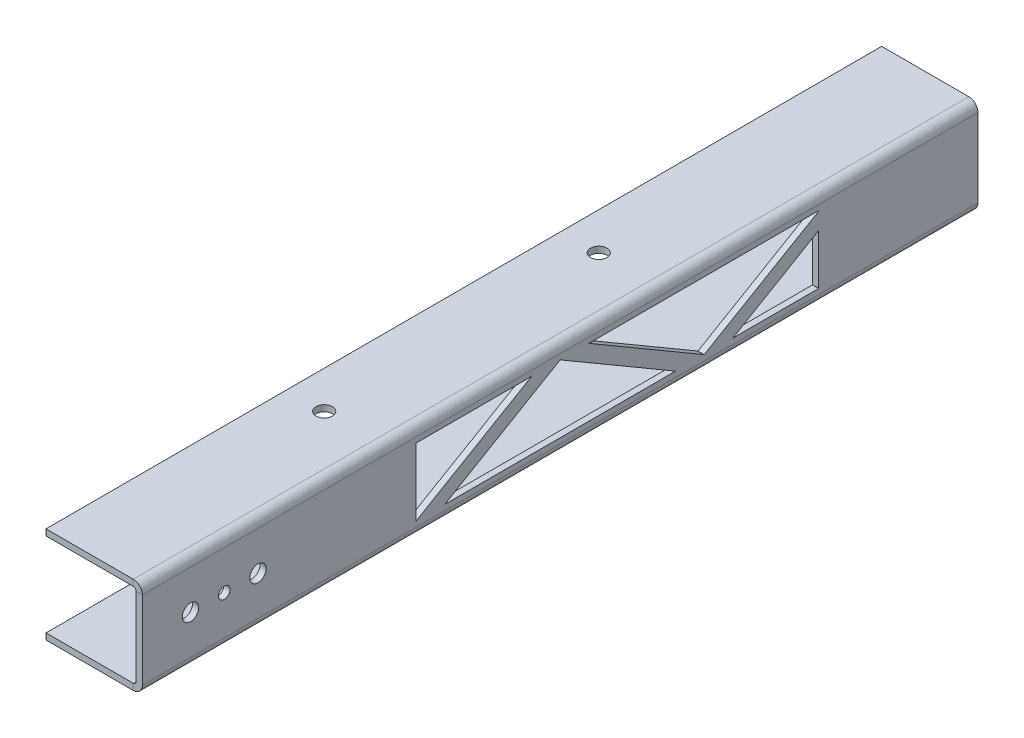
ISO-10303-21;
HEADER;
FILE_DESCRIPTION(('STEP AP214'),'2;1');
FILE_NAME('part.step','',(''),(''),'','','');
FILE_SCHEMA(('AUTOMOTIVE_DESIGN { 1 0 10303 214 1 1 1 1 }'));
ENDSEC;
DATA;
#1=APPLICATION_CONTEXT('core data for automotive mechanical design processes');
#2=APPLICATION_PROTOCOL_DEFINITION('international standard','automotive_design',2000,#1);
#3=PRODUCT_CONTEXT('',#1,'mechanical');
#4=PRODUCT('Part','Part','',(#3));
#5=PRODUCT_RELATED_PRODUCT_CATEGORY('part','',(#4));
#6=PRODUCT_DEFINITION_FORMATION('','',#4);
#7=PRODUCT_DEFINITION_CONTEXT('part definition',#1,'design');
#8=PRODUCT_DEFINITION('design','',#6,#7);
#9=PRODUCT_DEFINITION_SHAPE('','',#8);
#10=(LENGTH_UNIT() NAMED_UNIT(*) SI_UNIT(.MILLI.,.METRE.));
#11=(NAMED_UNIT(*) PLANE_ANGLE_UNIT() SI_UNIT($,.RADIAN.));
#12=(NAMED_UNIT(*) SI_UNIT($,.STERADIAN.) SOLID_ANGLE_UNIT());
#13=UNCERTAINTY_MEASURE_WITH_UNIT(LENGTH_MEASURE(1.E-05),#10,'distance_accuracy_value','');
#14=(GEOMETRIC_REPRESENTATION_CONTEXT(3) GLOBAL_UNCERTAINTY_ASSIGNED_CONTEXT((#13)) GLOBAL_UNIT_ASSIGNED_CONTEXT((#10,
#11,#12)) REPRESENTATION_CONTEXT('',''));
#15=CARTESIAN_POINT('',(0.,0.,0.));
#16=DIRECTION('',(0.,0.,1.));
#17=DIRECTION('',(1.,0.,0.));
#18=AXIS2_PLACEMENT_3D('',#15,#16,#17);
#19=CARTESIAN_POINT('',(0.,20.,0.));
#20=DIRECTION('',(0.,0.,1.));
#21=DIRECTION('',(1.,0.,0.));
#22=AXIS2_PLACEMENT_3D('',#19,#20,#21);
#23=PLANE('',#22);
#24=DIRECTION('',(0.,1.,0.));
#25=VECTOR('',#24,1.);
#26=CARTESIAN_POINT('',(18.11,20.,0.));
#27=LINE('',#26,#25);
#28=CARTESIAN_POINT('',(18.11,18.71,0.));
#29=VERTEX_POINT('',#28);
#30=CARTESIAN_POINT('',(18.11,20.,0.));
#31=VERTEX_POINT('',#30);
#32=EDGE_CURVE('E438',#29,#31,#27,.T.);
#33=ORIENTED_EDGE('',*,*,#32,.F.);
#34=DIRECTION('',(1.,0.,0.));
#35=VECTOR('',#34,1.);
#36=CARTESIAN_POINT('',(0.,18.71,0.));
#37=LINE('',#36,#35);
#38=CARTESIAN_POINT('',(0.,18.71,0.));
#39=VERTEX_POINT('',#38);
#40=EDGE_CURVE('E401',#39,#29,#37,.T.);
#41=ORIENTED_EDGE('',*,*,#40,.F.);
#42=DIRECTION('',(0.,1.,0.));
#43=VECTOR('',#42,1.);
#44=CARTESIAN_POINT('',(0.,20.,0.));
#45=LINE('',#44,#43);
#46=CARTESIAN_POINT('',(0.,20.,0.));
#47=VERTEX_POINT('',#46);
#48=EDGE_CURVE('E436',#39,#47,#45,.T.);
#49=ORIENTED_EDGE('',*,*,#48,.T.);
#50=DIRECTION('',(1.,0.,0.));
#51=VECTOR('',#50,1.);
#52=CARTESIAN_POINT('',(0.,20.,0.));
#53=LINE('',#52,#51);
#54=EDGE_CURVE('E332',#47,#31,#53,.T.);
#55=ORIENTED_EDGE('',*,*,#54,.T.);
#56=EDGE_LOOP('',(#33,#41,#49,#55));
#57=FACE_BOUND('',#56,.T.);
#58=ADVANCED_FACE('F37',(#57),#23,.F.);
#59=CARTESIAN_POINT('',(0.,20.,173.5));
#60=DIRECTION('',(1.,0.,0.));
#61=DIRECTION('',(0.,0.,-1.));
#62=AXIS2_PLACEMENT_3D('',#59,#60,#61);
#63=PLANE('',#62);
#64=ORIENTED_EDGE('',*,*,#48,.F.);
#65=DIRECTION('',(0.,0.,1.));
#66=VECTOR('',#65,1.);
#67=CARTESIAN_POINT('',(0.,18.71,173.5));
#68=LINE('',#67,#66);
#69=CARTESIAN_POINT('',(0.,18.71,173.5));
#70=VERTEX_POINT('',#69);
#71=EDGE_CURVE('E412',#70,#39,#68,.F.);
#72=ORIENTED_EDGE('',*,*,#71,.F.);
#73=DIRECTION('',(0.,1.,0.));
#74=VECTOR('',#73,1.);
#75=CARTESIAN_POINT('',(0.,20.,173.5));
#76=LINE('',#75,#74);
#77=CARTESIAN_POINT('',(0.,20.,173.5));
#78=VERTEX_POINT('',#77);
#79=EDGE_CURVE('E434',#70,#78,#76,.T.);
#80=ORIENTED_EDGE('',*,*,#79,.T.);
#81=DIRECTION('',(0.,0.,-1.));
#82=VECTOR('',#81,1.);
#83=CARTESIAN_POINT('',(0.,20.,173.5));
#84=LINE('',#83,#82);
#85=EDGE_CURVE('E335',#78,#47,#84,.T.);
#86=ORIENTED_EDGE('',*,*,#85,.T.);
#87=EDGE_LOOP('',(#64,#72,#80,#86));
#88=FACE_BOUND('',#87,.T.);
#89=ADVANCED_FACE('F493',(#88),#63,.F.);
#90=CARTESIAN_POINT('',(0.,20.,173.5));
#91=DIRECTION('',(0.,0.,1.));
#92=DIRECTION('',(1.,0.,0.));
#93=AXIS2_PLACEMENT_3D('',#90,#91,#92);
#94=PLANE('',#93);
#95=ORIENTED_EDGE('',*,*,#79,.F.);
#96=DIRECTION('',(1.,0.,0.));
#97=VECTOR('',#96,1.);
#98=CARTESIAN_POINT('',(0.,18.71,173.5));
#99=LINE('',#98,#97);
#100=CARTESIAN_POINT('',(18.11,18.71,173.5));
#101=VERTEX_POINT('',#100);
#102=EDGE_CURVE('E409',#70,#101,#99,.T.);
#103=ORIENTED_EDGE('',*,*,#102,.T.);
#104=DIRECTION('',(0.,1.,0.));
#105=VECTOR('',#104,1.);
#106=CARTESIAN_POINT('',(18.11,20.,173.5));
#107=LINE('',#106,#105);
#108=CARTESIAN_POINT('',(18.11,20.,173.5));
#109=VERTEX_POINT('',#108);
#110=EDGE_CURVE('E432',#101,#109,#107,.T.);
#111=ORIENTED_EDGE('',*,*,#110,.T.);
#112=DIRECTION('',(1.,0.,0.));
#113=VECTOR('',#112,1.);
#114=CARTESIAN_POINT('',(0.,20.,173.5));
#115=LINE('',#114,#113);
#116=EDGE_CURVE('E339',#78,#109,#115,.T.);
#117=ORIENTED_EDGE('',*,*,#116,.F.);
#118=EDGE_LOOP('',(#95,#103,#111,#117));
#119=FACE_BOUND('',#118,.T.);
#120=ADVANCED_FACE('F498',(#119),#94,.T.);
#121=CARTESIAN_POINT('',(18.11,18.11,173.5));
#122=DIRECTION('',(0.,0.,1.));
#123=DIRECTION('',(1.,0.,0.));
#124=AXIS2_PLACEMENT_3D('',#121,#122,#123);
#125=PLANE('',#124);
#126=ORIENTED_EDGE('',*,*,#110,.F.);
#127=CARTESIAN_POINT('',(18.11,18.11,173.5));
#128=DIRECTION('',(0.,0.,1.));
#129=DIRECTION('',(1.,0.,0.));
#130=AXIS2_PLACEMENT_3D('',#127,#128,#129);
#131=CIRCLE('',#130,0.6);
#132=CARTESIAN_POINT('',(18.71,18.11,173.5));
#133=VERTEX_POINT('',#132);
#134=EDGE_CURVE('E406',#101,#133,#131,.F.);
#135=ORIENTED_EDGE('',*,*,#134,.T.);
#136=DIRECTION('',(1.,0.,0.));
#137=VECTOR('',#136,1.);
#138=CARTESIAN_POINT('',(20.,18.11,173.5));
#139=LINE('',#138,#137);
#140=CARTESIAN_POINT('',(20.,18.11,173.5));
#141=VERTEX_POINT('',#140);
#142=EDGE_CURVE('E429',#133,#141,#139,.T.);
#143=ORIENTED_EDGE('',*,*,#142,.T.);
#144=CARTESIAN_POINT('',(18.11,18.11,173.5));
#145=DIRECTION('',(0.,0.,-1.));
#146=DIRECTION('',(-1.,0.,0.));
#147=AXIS2_PLACEMENT_3D('',#144,#145,#146);
#148=CIRCLE('',#147,1.89);
#149=EDGE_CURVE('E365',#109,#141,#148,.T.);
#150=ORIENTED_EDGE('',*,*,#149,.F.);
#151=EDGE_LOOP('',(#126,#135,#143,#150));
#152=FACE_BOUND('',#151,.T.);
#153=ADVANCED_FACE('F504',(#152),#125,.T.);
#154=CARTESIAN_POINT('',(18.11,1.89,173.5));
#155=DIRECTION('',(0.,0.,-1.));
#156=DIRECTION('',(-1.,0.,0.));
#157=AXIS2_PLACEMENT_3D('',#154,#155,#156);
#158=PLANE('',#157);
#159=CARTESIAN_POINT('',(18.11,1.89,173.5));
#160=DIRECTION('',(0.,0.,1.));
#161=DIRECTION('',(1.,0.,0.));
#162=AXIS2_PLACEMENT_3D('',#159,#160,#161);
#163=CIRCLE('',#162,1.89);
#164=CARTESIAN_POINT('',(20.,1.89,173.5));
#165=VERTEX_POINT('',#164);
#166=CARTESIAN_POINT('',(18.11,0.,173.5));
#167=VERTEX_POINT('',#166);
#168=EDGE_CURVE('E336',#165,#167,#163,.F.);
#169=ORIENTED_EDGE('',*,*,#168,.F.);
#170=DIRECTION('',(0.,1.,0.));
#171=VECTOR('',#170,1.);
#172=CARTESIAN_POINT('',(20.,0.,173.5));
#173=LINE('',#172,#171);
#174=EDGE_CURVE('E344',#165,#141,#173,.T.);
#175=ORIENTED_EDGE('',*,*,#174,.T.);
#176=ORIENTED_EDGE('',*,*,#142,.F.);
#177=DIRECTION('',(0.,1.,0.));
#178=VECTOR('',#177,1.);
#179=CARTESIAN_POINT('',(18.71,0.,173.5));
#180=LINE('',#179,#178);
#181=CARTESIAN_POINT('',(18.71,1.89,173.5));
#182=VERTEX_POINT('',#181);
#183=EDGE_CURVE('E393',#182,#133,#180,.T.);
#184=ORIENTED_EDGE('',*,*,#183,.F.);
#185=CARTESIAN_POINT('',(18.11,1.89,173.5));
#186=DIRECTION('',(0.,0.,-1.));
#187=DIRECTION('',(-1.,0.,0.));
#188=AXIS2_PLACEMENT_3D('',#185,#186,#187);
#189=CIRCLE('',#188,0.6);
#190=CARTESIAN_POINT('',(18.11,1.29,173.5));
#191=VERTEX_POINT('',#190);
#192=EDGE_CURVE('E398',#182,#191,#189,.T.);
#193=ORIENTED_EDGE('',*,*,#192,.T.);
#194=DIRECTION('',(0.,-1.,0.));
#195=VECTOR('',#194,1.);
#196=CARTESIAN_POINT('',(18.11,0.,173.5));
#197=LINE('',#196,#195);
#198=EDGE_CURVE('E427',#191,#167,#197,.T.);
#199=ORIENTED_EDGE('',*,*,#198,.T.);
#200=EDGE_LOOP('',(#169,#175,#176,#184,#193,#199));
#201=FACE_BOUND('',#200,.T.);
#202=ADVANCED_FACE('F508',(#201),#158,.F.);
#203=CARTESIAN_POINT('',(0.,0.,173.5));
#204=DIRECTION('',(0.,0.,1.));
#205=DIRECTION('',(1.,0.,0.));
#206=AXIS2_PLACEMENT_3D('',#203,#204,#205);
#207=PLANE('',#206);
#208=ORIENTED_EDGE('',*,*,#198,.F.);
#209=DIRECTION('',(1.,0.,0.));
#210=VECTOR('',#209,1.);
#211=CARTESIAN_POINT('',(0.,1.29,173.5));
#212=LINE('',#211,#210);
#213=CARTESIAN_POINT('',(0.,1.29,173.5));
#214=VERTEX_POINT('',#213);
#215=EDGE_CURVE('E392',#214,#191,#212,.T.);
#216=ORIENTED_EDGE('',*,*,#215,.F.);
#217=DIRECTION('',(0.,-1.,0.));
#218=VECTOR('',#217,1.);
#219=CARTESIAN_POINT('',(0.,0.,173.5));
#220=LINE('',#219,#218);
#221=CARTESIAN_POINT('',(0.,0.,173.5));
#222=VERTEX_POINT('',#221);
#223=EDGE_CURVE('E425',#214,#222,#220,.T.);
#224=ORIENTED_EDGE('',*,*,#223,.T.);
#225=DIRECTION('',(1.,0.,0.));
#226=VECTOR('',#225,1.);
#227=CARTESIAN_POINT('',(0.,0.,173.5));
#228=LINE('',#227,#226);
#229=EDGE_CURVE('E350',#222,#167,#228,.T.);
#230=ORIENTED_EDGE('',*,*,#229,.T.);
#231=EDGE_LOOP('',(#208,#216,#224,#230));
#232=FACE_BOUND('',#231,.T.);
#233=ADVANCED_FACE('F512',(#232),#207,.T.);
#234=CARTESIAN_POINT('',(0.,0.,173.5));
#235=DIRECTION('',(1.,0.,0.));
#236=DIRECTION('',(0.,0.,-1.));
#237=AXIS2_PLACEMENT_3D('',#234,#235,#236);
#238=PLANE('',#237);
#239=ORIENTED_EDGE('',*,*,#223,.F.);
#240=DIRECTION('',(0.,0.,1.));
#241=VECTOR('',#240,1.);
#242=CARTESIAN_POINT('',(0.,1.29,173.5));
#243=LINE('',#242,#241);
#244=CARTESIAN_POINT('',(0.,1.29,0.));
#245=VERTEX_POINT('',#244);
#246=EDGE_CURVE('E385',#214,#245,#243,.F.);
#247=ORIENTED_EDGE('',*,*,#246,.T.);
#248=DIRECTION('',(0.,-1.,0.));
#249=VECTOR('',#248,1.);
#250=CARTESIAN_POINT('',(0.,0.,0.));
#251=LINE('',#250,#249);
#252=CARTESIAN_POINT('',(0.,0.,0.));
#253=VERTEX_POINT('',#252);
#254=EDGE_CURVE('E423',#245,#253,#251,.T.);
#255=ORIENTED_EDGE('',*,*,#254,.T.);
#256=DIRECTION('',(0.,0.,-1.));
#257=VECTOR('',#256,1.);
#258=CARTESIAN_POINT('',(0.,0.,173.5));
#259=LINE('',#258,#257);
#260=EDGE_CURVE('E353',#222,#253,#259,.T.);
#261=ORIENTED_EDGE('',*,*,#260,.F.);
#262=EDGE_LOOP('',(#239,#247,#255,#261));
#263=FACE_BOUND('',#262,.T.);
#264=ADVANCED_FACE('F516',(#263),#238,.F.);
#265=CARTESIAN_POINT('',(0.,0.,0.));
#266=DIRECTION('',(0.,0.,1.));
#267=DIRECTION('',(1.,0.,0.));
#268=AXIS2_PLACEMENT_3D('',#265,#266,#267);
#269=PLANE('',#268);
#270=ORIENTED_EDGE('',*,*,#254,.F.);
#271=DIRECTION('',(1.,0.,0.));
#272=VECTOR('',#271,1.);
#273=CARTESIAN_POINT('',(0.,1.29,0.));
#274=LINE('',#273,#272);
#275=CARTESIAN_POINT('',(18.11,1.29,0.));
#276=VERTEX_POINT('',#275);
#277=EDGE_CURVE('E389',#245,#276,#274,.T.);
#278=ORIENTED_EDGE('',*,*,#277,.T.);
#279=DIRECTION('',(0.,-1.,0.));
#280=VECTOR('',#279,1.);
#281=CARTESIAN_POINT('',(18.11,0.,0.));
#282=LINE('',#281,#280);
#283=CARTESIAN_POINT('',(18.11,0.,0.));
#284=VERTEX_POINT('',#283);
#285=EDGE_CURVE('E372',#276,#284,#282,.T.);
#286=ORIENTED_EDGE('',*,*,#285,.T.);
#287=DIRECTION('',(1.,0.,0.));
#288=VECTOR('',#287,1.);
#289=CARTESIAN_POINT('',(0.,0.,0.));
#290=LINE('',#289,#288);
#291=EDGE_CURVE('E347',#253,#284,#290,.T.);
#292=ORIENTED_EDGE('',*,*,#291,.F.);
#293=EDGE_LOOP('',(#270,#278,#286,#292));
#294=FACE_BOUND('',#293,.T.);
#295=ADVANCED_FACE('F520',(#294),#269,.F.);
#296=CARTESIAN_POINT('',(18.11,1.89,0.));
#297=DIRECTION('',(0.,0.,1.));
#298=DIRECTION('',(1.,0.,0.));
#299=AXIS2_PLACEMENT_3D('',#296,#297,#298);
#300=PLANE('',#299);
#301=CARTESIAN_POINT('',(18.11,1.89,0.));
#302=DIRECTION('',(0.,0.,-1.));
#303=DIRECTION('',(-1.,0.,0.));
#304=AXIS2_PLACEMENT_3D('',#301,#302,#303);
#305=CIRCLE('',#304,0.6);
#306=CARTESIAN_POINT('',(18.71,1.89,0.));
#307=VERTEX_POINT('',#306);
#308=EDGE_CURVE('E402',#276,#307,#305,.F.);
#309=ORIENTED_EDGE('',*,*,#308,.T.);
#310=DIRECTION('',(0.,1.,0.));
#311=VECTOR('',#310,1.);
#312=CARTESIAN_POINT('',(18.71,0.,0.));
#313=LINE('',#312,#311);
#314=CARTESIAN_POINT('',(18.71,18.11,0.));
#315=VERTEX_POINT('',#314);
#316=EDGE_CURVE('E405',#307,#315,#313,.T.);
#317=ORIENTED_EDGE('',*,*,#316,.T.);
#318=CARTESIAN_POINT('',(18.11,18.11,0.));
#319=DIRECTION('',(0.,0.,1.));
#320=DIRECTION('',(1.,0.,0.));
#321=AXIS2_PLACEMENT_3D('',#318,#319,#320);
#322=CIRCLE('',#321,0.6);
#323=EDGE_CURVE('E331',#315,#29,#322,.T.);
#324=ORIENTED_EDGE('',*,*,#323,.T.);
#325=ORIENTED_EDGE('',*,*,#32,.T.);
#326=CARTESIAN_POINT('',(18.11,18.11,0.));
#327=DIRECTION('',(0.,0.,1.));
#328=DIRECTION('',(1.,0.,0.));
#329=AXIS2_PLACEMENT_3D('',#326,#327,#328);
#330=CIRCLE('',#329,1.89);
#331=CARTESIAN_POINT('',(20.,18.11,0.));
#332=VERTEX_POINT('',#331);
#333=EDGE_CURVE('E373',#332,#31,#330,.T.);
#334=ORIENTED_EDGE('',*,*,#333,.F.);
#335=DIRECTION('',(0.,1.,0.));
#336=VECTOR('',#335,1.);
#337=CARTESIAN_POINT('',(20.,0.,0.));
#338=LINE('',#337,#336);
#339=CARTESIAN_POINT('',(20.,1.89,0.));
#340=VERTEX_POINT('',#339);
#341=EDGE_CURVE('E342',#340,#332,#338,.T.);
#342=ORIENTED_EDGE('',*,*,#341,.F.);
#343=CARTESIAN_POINT('',(18.11,1.89,0.));
#344=DIRECTION('',(0.,0.,-1.));
#345=DIRECTION('',(-1.,0.,0.));
#346=AXIS2_PLACEMENT_3D('',#343,#344,#345);
#347=CIRCLE('',#346,1.89);
#348=EDGE_CURVE('E362',#284,#340,#347,.F.);
#349=ORIENTED_EDGE('',*,*,#348,.F.);
#350=ORIENTED_EDGE('',*,*,#285,.F.);
#351=EDGE_LOOP('',(#309,#317,#324,#325,#334,#342,#349,#350));
#352=FACE_BOUND('',#351,.T.);
#353=ADVANCED_FACE('F39',(#352),#300,.F.);
#354=CARTESIAN_POINT('',(0.,0.,173.5));
#355=DIRECTION('',(0.,1.,0.));
#356=DIRECTION('',(0.,0.,1.));
#357=AXIS2_PLACEMENT_3D('',#354,#355,#356);
#358=PLANE('',#357);
#359=CARTESIAN_POINT('',(7.76200000000002,0.,123.5));
#360=DIRECTION('',(0.,1.,0.));
#361=DIRECTION('',(0.,0.,1.));
#362=AXIS2_PLACEMENT_3D('',#359,#360,#361);
#363=CIRCLE('',#362,1.69999999999999);
#364=CARTESIAN_POINT('',(7.76200000000002,0.,125.2));
#365=VERTEX_POINT('',#364);
#366=EDGE_CURVE('E252',#365,#365,#363,.T.);
#367=ORIENTED_EDGE('',*,*,#366,.T.);
#368=EDGE_LOOP('',(#367));
#369=FACE_BOUND('',#368,.T.);
#370=CARTESIAN_POINT('',(7.76199999999994,0.,66.5000000000001));
#371=DIRECTION('',(0.,1.,0.));
#372=DIRECTION('',(0.,0.,1.));
#373=AXIS2_PLACEMENT_3D('',#370,#371,#372);
#374=CIRCLE('',#373,1.69999999999999);
#375=CARTESIAN_POINT('',(7.76199999999994,0.,68.2000000000001));
#376=VERTEX_POINT('',#375);
#377=EDGE_CURVE('E248',#376,#376,#374,.T.);
#378=ORIENTED_EDGE('',*,*,#377,.T.);
#379=EDGE_LOOP('',(#378));
#380=FACE_BOUND('',#379,.T.);
#381=ORIENTED_EDGE('',*,*,#291,.T.);
#382=DIRECTION('',(0.,0.,-1.));
#383=VECTOR('',#382,1.);
#384=CARTESIAN_POINT('',(18.11,0.,173.5));
#385=LINE('',#384,#383);
#386=EDGE_CURVE('E358',#284,#167,#385,.F.);
#387=ORIENTED_EDGE('',*,*,#386,.T.);
#388=ORIENTED_EDGE('',*,*,#229,.F.);
#389=ORIENTED_EDGE('',*,*,#260,.T.);
#390=EDGE_LOOP('',(#381,#387,#388,#389));
#391=FACE_BOUND('',#390,.T.);
#392=ADVANCED_FACE('F546',(#369,#380,#391),#358,.F.);
#393=CARTESIAN_POINT('',(20.,0.,173.5));
#394=DIRECTION('',(-1.,0.,0.));
#395=DIRECTION('',(0.,0.,1.));
#396=AXIS2_PLACEMENT_3D('',#393,#394,#395);
#397=PLANE('',#396);
#398=DIRECTION('',(0.,-1.,0.));
#399=VECTOR('',#398,1.);
#400=CARTESIAN_POINT('',(20.,18.11,33.0836938402967));
#401=LINE('',#400,#399);
#402=CARTESIAN_POINT('',(20.,13.4168722561756,33.0836938402967));
#403=VERTEX_POINT('',#402);
#404=CARTESIAN_POINT('',(20.,3.,33.0836938402967));
#405=VERTEX_POINT('',#404);
#406=EDGE_CURVE('E461',#403,#405,#401,.T.);
#407=ORIENTED_EDGE('',*,*,#406,.T.);
#408=DIRECTION('',(0.,0.,-1.));
#409=VECTOR('',#408,1.);
#410=CARTESIAN_POINT('',(20.,3.,3.));
#411=LINE('',#410,#409);
#412=CARTESIAN_POINT('',(20.,3.,50.9063474826974));
#413=VERTEX_POINT('',#412);
#414=EDGE_CURVE('E52',#413,#405,#411,.T.);
#415=ORIENTED_EDGE('',*,*,#414,.F.);
#416=DIRECTION('',(0.,-0.504605416910022,0.863350087290818));
#417=VECTOR('',#416,1.);
#418=CARTESIAN_POINT('',(20.,3.,50.9063474826974));
#419=LINE('',#418,#417);
#420=EDGE_CURVE('E327',#403,#413,#419,.T.);
#421=ORIENTED_EDGE('',*,*,#420,.F.);
#422=EDGE_LOOP('',(#407,#415,#421));
#423=FACE_BOUND('',#422,.T.);
#424=CARTESIAN_POINT('',(20.,17.,33.0836938402967));
#425=VERTEX_POINT('',#424);
#426=CARTESIAN_POINT('',(20.,16.8917082979648,33.0836938402967));
#427=VERTEX_POINT('',#426);
#428=EDGE_CURVE('E207',#425,#427,#401,.T.);
#429=ORIENTED_EDGE('',*,*,#428,.T.);
#430=DIRECTION('',(0.,0.504605416910023,-0.863350087290818));
#431=VECTOR('',#430,1.);
#432=CARTESIAN_POINT('',(20.,3.,56.8515868706743));
#433=LINE('',#432,#431);
#434=CARTESIAN_POINT('',(20.,3.,56.8515868706743));
#435=VERTEX_POINT('',#434);
#436=EDGE_CURVE('E305',#435,#427,#433,.T.);
#437=ORIENTED_EDGE('',*,*,#436,.F.);
#438=DIRECTION('',(0.,-0.504605416910022,-0.863350087290818));
#439=VECTOR('',#438,1.);
#440=CARTESIAN_POINT('',(20.,17.,80.804760612023));
#441=LINE('',#440,#439);
#442=CARTESIAN_POINT('',(20.,17.,80.804760612023));
#443=VERTEX_POINT('',#442);
#444=EDGE_CURVE('E302',#443,#435,#441,.T.);
#445=ORIENTED_EDGE('',*,*,#444,.F.);
#446=DIRECTION('',(0.,0.,1.));
#447=VECTOR('',#446,1.);
#448=CARTESIAN_POINT('',(20.,17.,32.8984131293257));
#449=LINE('',#448,#447);
#450=EDGE_CURVE('E298',#425,#443,#449,.T.);
#451=ORIENTED_EDGE('',*,*,#450,.F.);
#452=EDGE_LOOP('',(#429,#437,#445,#451));
#453=FACE_BOUND('',#452,.T.);
#454=CARTESIAN_POINT('',(20.,9.99999999999998,156.5));
#455=DIRECTION('',(-1.,0.,0.));
#456=DIRECTION('',(0.,0.,1.));
#457=AXIS2_PLACEMENT_3D('',#454,#455,#456);
#458=CIRCLE('',#457,1.20000000000001);
#459=CARTESIAN_POINT('',(20.,9.99999999999998,157.7));
#460=VERTEX_POINT('',#459);
#461=EDGE_CURVE('E276',#460,#460,#458,.T.);
#462=ORIENTED_EDGE('',*,*,#461,.T.);
#463=EDGE_LOOP('',(#462));
#464=FACE_BOUND('',#463,.T.);
#465=CARTESIAN_POINT('',(20.,10.,163.5));
#466=DIRECTION('',(-1.,0.,0.));
#467=DIRECTION('',(0.,0.,1.));
#468=AXIS2_PLACEMENT_3D('',#465,#466,#467);
#469=CIRCLE('',#468,1.69999999999999);
#470=CARTESIAN_POINT('',(20.,10.,165.2));
#471=VERTEX_POINT('',#470);
#472=EDGE_CURVE('E241',#471,#471,#469,.T.);
#473=ORIENTED_EDGE('',*,*,#472,.T.);
#474=EDGE_LOOP('',(#473));
#475=FACE_BOUND('',#474,.T.);
#476=CARTESIAN_POINT('',(20.,10.,149.5));
#477=DIRECTION('',(-1.,0.,0.));
#478=DIRECTION('',(0.,0.,1.));
#479=AXIS2_PLACEMENT_3D('',#476,#477,#478);
#480=CIRCLE('',#479,1.69999999999999);
#481=CARTESIAN_POINT('',(20.,10.,151.2));
#482=VERTEX_POINT('',#481);
#483=EDGE_CURVE('E236',#482,#482,#480,.T.);
#484=ORIENTED_EDGE('',*,*,#483,.T.);
#485=EDGE_LOOP('',(#484));
#486=FACE_BOUND('',#485,.T.);
#487=DIRECTION('',(0.,0.504605416910022,-0.863350087290818));
#488=VECTOR('',#487,1.);
#489=CARTESIAN_POINT('',(20.,17.,92.695239387977));
#490=LINE('',#489,#488);
#491=CARTESIAN_POINT('',(20.,3.,116.648413129326));
#492=VERTEX_POINT('',#491);
#493=CARTESIAN_POINT('',(20.,17.,92.695239387977));
#494=VERTEX_POINT('',#493);
#495=EDGE_CURVE('E289',#492,#494,#490,.T.);
#496=ORIENTED_EDGE('',*,*,#495,.F.);
#497=DIRECTION('',(0.,1.,0.));
#498=VECTOR('',#497,1.);
#499=CARTESIAN_POINT('',(20.,1.89,116.648413129326));
#500=LINE('',#499,#498);
#501=CARTESIAN_POINT('',(20.,17.,116.648413129326));
#502=VERTEX_POINT('',#501);
#503=EDGE_CURVE('E239',#492,#502,#500,.T.);
#504=ORIENTED_EDGE('',*,*,#503,.T.);
#505=DIRECTION('',(0.,0.,1.));
#506=VECTOR('',#505,1.);
#507=CARTESIAN_POINT('',(20.,17.,140.601586870674));
#508=LINE('',#507,#506);
#509=EDGE_CURVE('E291',#494,#502,#508,.T.);
#510=ORIENTED_EDGE('',*,*,#509,.F.);
#511=EDGE_LOOP('',(#496,#504,#510));
#512=FACE_BOUND('',#511,.T.);
#513=DIRECTION('',(0.,0.,-1.));
#514=VECTOR('',#513,1.);
#515=CARTESIAN_POINT('',(20.,3.,62.7968262586513));
#516=LINE('',#515,#514);
#517=CARTESIAN_POINT('',(20.,3.,110.703173741349));
#518=VERTEX_POINT('',#517);
#519=CARTESIAN_POINT('',(20.,3.,62.7968262586513));
#520=VERTEX_POINT('',#519);
#521=EDGE_CURVE('E313',#518,#520,#516,.T.);
#522=ORIENTED_EDGE('',*,*,#521,.F.);
#523=DIRECTION('',(0.,-0.504605416910022,0.863350087290818));
#524=VECTOR('',#523,1.);
#525=CARTESIAN_POINT('',(20.,17.,86.75));
#526=LINE('',#525,#524);
#527=CARTESIAN_POINT('',(20.,17.,86.75));
#528=VERTEX_POINT('',#527);
#529=EDGE_CURVE('E310',#528,#518,#526,.T.);
#530=ORIENTED_EDGE('',*,*,#529,.F.);
#531=DIRECTION('',(0.,0.504605416910022,0.863350087290818));
#532=VECTOR('',#531,1.);
#533=CARTESIAN_POINT('',(20.,17.,86.75));
#534=LINE('',#533,#532);
#535=EDGE_CURVE('E316',#520,#528,#534,.T.);
#536=ORIENTED_EDGE('',*,*,#535,.F.);
#537=EDGE_LOOP('',(#522,#530,#536));
#538=FACE_BOUND('',#537,.T.);
#539=DIRECTION('',(0.,0.,-1.));
#540=VECTOR('',#539,1.);
#541=CARTESIAN_POINT('',(20.,1.89,173.5));
#542=LINE('',#541,#540);
#543=EDGE_CURVE('E356',#165,#340,#542,.T.);
#544=ORIENTED_EDGE('',*,*,#543,.T.);
#545=ORIENTED_EDGE('',*,*,#341,.T.);
#546=DIRECTION('',(0.,0.,-1.));
#547=VECTOR('',#546,1.);
#548=CARTESIAN_POINT('',(20.,18.11,173.5));
#549=LINE('',#548,#547);
#550=EDGE_CURVE('E370',#332,#141,#549,.F.);
#551=ORIENTED_EDGE('',*,*,#550,.T.);
#552=ORIENTED_EDGE('',*,*,#174,.F.);
#553=EDGE_LOOP('',(#544,#545,#551,#552));
#554=FACE_BOUND('',#553,.T.);
#555=ADVANCED_FACE('F459',(#423,#453,#464,#475,#486,#512,#538,#554),#397,.F.);
#556=CARTESIAN_POINT('',(0.,20.,173.5));
#557=DIRECTION('',(0.,1.,0.));
#558=DIRECTION('',(0.,0.,1.));
#559=AXIS2_PLACEMENT_3D('',#556,#557,#558);
#560=PLANE('',#559);
#561=CARTESIAN_POINT('',(7.76200000000002,20.,123.5));
#562=DIRECTION('',(0.,1.,0.));
#563=DIRECTION('',(0.,0.,1.));
#564=AXIS2_PLACEMENT_3D('',#561,#562,#563);
#565=CIRCLE('',#564,1.7);
#566=CARTESIAN_POINT('',(7.76200000000002,20.,125.2));
#567=VERTEX_POINT('',#566);
#568=EDGE_CURVE('E259',#567,#567,#565,.T.);
#569=ORIENTED_EDGE('',*,*,#568,.F.);
#570=EDGE_LOOP('',(#569));
#571=FACE_BOUND('',#570,.T.);
#572=CARTESIAN_POINT('',(7.76199999999994,20.,66.5000000000001));
#573=DIRECTION('',(0.,1.,0.));
#574=DIRECTION('',(0.,0.,1.));
#575=AXIS2_PLACEMENT_3D('',#572,#573,#574);
#576=CIRCLE('',#575,1.7);
#577=CARTESIAN_POINT('',(7.76199999999994,20.,68.2000000000001));
#578=VERTEX_POINT('',#577);
#579=EDGE_CURVE('E256',#578,#578,#576,.T.);
#580=ORIENTED_EDGE('',*,*,#579,.F.);
#581=EDGE_LOOP('',(#580));
#582=FACE_BOUND('',#581,.T.);
#583=ORIENTED_EDGE('',*,*,#116,.T.);
#584=DIRECTION('',(0.,0.,-1.));
#585=VECTOR('',#584,1.);
#586=CARTESIAN_POINT('',(18.11,20.,0.));
#587=LINE('',#586,#585);
#588=EDGE_CURVE('E361',#109,#31,#587,.T.);
#589=ORIENTED_EDGE('',*,*,#588,.T.);
#590=ORIENTED_EDGE('',*,*,#54,.F.);
#591=ORIENTED_EDGE('',*,*,#85,.F.);
#592=EDGE_LOOP('',(#583,#589,#590,#591));
#593=FACE_BOUND('',#592,.T.);
#594=ADVANCED_FACE('F544',(#571,#582,#593),#560,.T.);
#595=CARTESIAN_POINT('',(18.11,1.89,173.5));
#596=DIRECTION('',(0.,0.,-1.));
#597=DIRECTION('',(-1.,0.,0.));
#598=AXIS2_PLACEMENT_3D('',#595,#596,#597);
#599=CYLINDRICAL_SURFACE('',#598,1.89);
#600=ORIENTED_EDGE('',*,*,#168,.T.);
#601=ORIENTED_EDGE('',*,*,#386,.F.);
#602=ORIENTED_EDGE('',*,*,#348,.T.);
#603=ORIENTED_EDGE('',*,*,#543,.F.);
#604=EDGE_LOOP('',(#600,#601,#602,#603));
#605=FACE_BOUND('',#604,.T.);
#606=ADVANCED_FACE('F540',(#605),#599,.T.);
#607=CARTESIAN_POINT('',(18.11,18.11,173.5));
#608=DIRECTION('',(0.,0.,1.));
#609=DIRECTION('',(1.,0.,0.));
#610=AXIS2_PLACEMENT_3D('',#607,#608,#609);
#611=CYLINDRICAL_SURFACE('',#610,1.89);
#612=ORIENTED_EDGE('',*,*,#149,.T.);
#613=ORIENTED_EDGE('',*,*,#550,.F.);
#614=ORIENTED_EDGE('',*,*,#333,.T.);
#615=ORIENTED_EDGE('',*,*,#588,.F.);
#616=EDGE_LOOP('',(#612,#613,#614,#615));
#617=FACE_BOUND('',#616,.T.);
#618=ADVANCED_FACE('F536',(#617),#611,.T.);
#619=CARTESIAN_POINT('',(0.,1.29,173.5));
#620=DIRECTION('',(0.,1.,0.));
#621=DIRECTION('',(0.,0.,1.));
#622=AXIS2_PLACEMENT_3D('',#619,#620,#621);
#623=PLANE('',#622);
#624=CARTESIAN_POINT('',(7.76200000000002,1.29,123.5));
#625=DIRECTION('',(0.,1.,0.));
#626=DIRECTION('',(0.,0.,1.));
#627=AXIS2_PLACEMENT_3D('',#624,#625,#626);
#628=CIRCLE('',#627,1.7);
#629=CARTESIAN_POINT('',(7.76200000000002,1.29,125.2));
#630=VERTEX_POINT('',#629);
#631=EDGE_CURVE('E251',#630,#630,#628,.T.);
#632=ORIENTED_EDGE('',*,*,#631,.F.);
#633=EDGE_LOOP('',(#632));
#634=FACE_BOUND('',#633,.T.);
#635=CARTESIAN_POINT('',(7.76199999999994,1.29,66.5000000000001));
#636=DIRECTION('',(0.,1.,0.));
#637=DIRECTION('',(0.,0.,1.));
#638=AXIS2_PLACEMENT_3D('',#635,#636,#637);
#639=CIRCLE('',#638,1.7);
#640=CARTESIAN_POINT('',(7.76199999999994,1.29,68.2000000000001));
#641=VERTEX_POINT('',#640);
#642=EDGE_CURVE('E247',#641,#641,#639,.T.);
#643=ORIENTED_EDGE('',*,*,#642,.F.);
#644=EDGE_LOOP('',(#643));
#645=FACE_BOUND('',#644,.T.);
#646=ORIENTED_EDGE('',*,*,#277,.F.);
#647=ORIENTED_EDGE('',*,*,#246,.F.);
#648=ORIENTED_EDGE('',*,*,#215,.T.);
#649=DIRECTION('',(0.,0.,1.));
#650=VECTOR('',#649,1.);
#651=CARTESIAN_POINT('',(18.11,1.29,173.5));
#652=LINE('',#651,#650);
#653=EDGE_CURVE('E379',#276,#191,#652,.T.);
#654=ORIENTED_EDGE('',*,*,#653,.F.);
#655=EDGE_LOOP('',(#646,#647,#648,#654));
#656=FACE_BOUND('',#655,.T.);
#657=ADVANCED_FACE('F533',(#634,#645,#656),#623,.T.);
#658=CARTESIAN_POINT('',(18.71,0.,173.5));
#659=DIRECTION('',(-1.,0.,0.));
#660=DIRECTION('',(0.,0.,1.));
#661=AXIS2_PLACEMENT_3D('',#658,#659,#660);
#662=PLANE('',#661);
#663=DIRECTION('',(0.,0.,1.));
#664=VECTOR('',#663,1.);
#665=CARTESIAN_POINT('',(18.71,2.99999999999999,173.5));
#666=LINE('',#665,#664);
#667=CARTESIAN_POINT('',(18.71,3.,33.0836938402967));
#668=VERTEX_POINT('',#667);
#669=CARTESIAN_POINT('',(18.71,3.,50.9063474826974));
#670=VERTEX_POINT('',#669);
#671=EDGE_CURVE('E443',#668,#670,#666,.T.);
#672=ORIENTED_EDGE('',*,*,#671,.F.);
#673=DIRECTION('',(0.,-1.,0.));
#674=VECTOR('',#673,1.);
#675=CARTESIAN_POINT('',(18.71,18.11,33.0836938402967));
#676=LINE('',#675,#674);
#677=CARTESIAN_POINT('',(18.71,13.4168722561756,33.0836938402967));
#678=VERTEX_POINT('',#677);
#679=EDGE_CURVE('E221',#678,#668,#676,.T.);
#680=ORIENTED_EDGE('',*,*,#679,.F.);
#681=DIRECTION('',(0.,0.504605416910022,-0.863350087290818));
#682=VECTOR('',#681,1.);
#683=CARTESIAN_POINT('',(18.71,-51.1719432206282,143.591345187711));
#684=LINE('',#683,#682);
#685=EDGE_CURVE('E440',#670,#678,#684,.T.);
#686=ORIENTED_EDGE('',*,*,#685,.F.);
#687=EDGE_LOOP('',(#672,#680,#686));
#688=FACE_BOUND('',#687,.T.);
#689=DIRECTION('',(0.,-0.504605416910023,0.863350087290818));
#690=VECTOR('',#689,1.);
#691=CARTESIAN_POINT('',(18.71,-48.5818929587558,145.105161438441));
#692=LINE('',#691,#690);
#693=CARTESIAN_POINT('',(18.71,16.8917082979648,33.0836938402967));
#694=VERTEX_POINT('',#693);
#695=CARTESIAN_POINT('',(18.71,3.00000000000001,56.8515868706743));
#696=VERTEX_POINT('',#695);
#697=EDGE_CURVE('E220',#694,#696,#692,.T.);
#698=ORIENTED_EDGE('',*,*,#697,.F.);
#699=CARTESIAN_POINT('',(18.71,17.,33.0836938402967));
#700=VERTEX_POINT('',#699);
#701=EDGE_CURVE('E205',#700,#694,#676,.T.);
#702=ORIENTED_EDGE('',*,*,#701,.F.);
#703=DIRECTION('',(0.,0.,-1.));
#704=VECTOR('',#703,1.);
#705=CARTESIAN_POINT('',(18.71,17.,173.5));
#706=LINE('',#705,#704);
#707=CARTESIAN_POINT('',(18.71,17.,80.804760612023));
#708=VERTEX_POINT('',#707);
#709=EDGE_CURVE('E219',#708,#700,#706,.T.);
#710=ORIENTED_EDGE('',*,*,#709,.F.);
#711=DIRECTION('',(0.,0.504605416910022,0.863350087290818));
#712=VECTOR('',#711,1.);
#713=CARTESIAN_POINT('',(18.71,53.0541331981061,142.49125465402));
#714=LINE('',#713,#712);
#715=EDGE_CURVE('E230',#696,#708,#714,.T.);
#716=ORIENTED_EDGE('',*,*,#715,.F.);
#717=EDGE_LOOP('',(#698,#702,#710,#716));
#718=FACE_BOUND('',#717,.T.);
#719=ORIENTED_EDGE('',*,*,#316,.F.);
#720=DIRECTION('',(0.,0.,1.));
#721=VECTOR('',#720,1.);
#722=CARTESIAN_POINT('',(18.71,1.89,173.5));
#723=LINE('',#722,#721);
#724=EDGE_CURVE('E383',#182,#307,#723,.F.);
#725=ORIENTED_EDGE('',*,*,#724,.F.);
#726=ORIENTED_EDGE('',*,*,#183,.T.);
#727=DIRECTION('',(0.,0.,1.));
#728=VECTOR('',#727,1.);
#729=CARTESIAN_POINT('',(18.71,18.11,173.5));
#730=LINE('',#729,#728);
#731=EDGE_CURVE('E376',#315,#133,#730,.T.);
#732=ORIENTED_EDGE('',*,*,#731,.F.);
#733=EDGE_LOOP('',(#719,#725,#726,#732));
#734=FACE_BOUND('',#733,.T.);
#735=CARTESIAN_POINT('',(18.71,9.99999999999998,156.5));
#736=DIRECTION('',(-1.,0.,0.));
#737=DIRECTION('',(0.,-1.,0.));
#738=AXIS2_PLACEMENT_3D('',#735,#736,#737);
#739=CIRCLE('',#738,1.20000000000001);
#740=CARTESIAN_POINT('',(18.71,8.79999999999996,156.5));
#741=VERTEX_POINT('',#740);
#742=EDGE_CURVE('E273',#741,#741,#739,.T.);
#743=ORIENTED_EDGE('',*,*,#742,.F.);
#744=EDGE_LOOP('',(#743));
#745=FACE_BOUND('',#744,.T.);
#746=CARTESIAN_POINT('',(18.71,10.,163.5));
#747=DIRECTION('',(-1.,0.,0.));
#748=DIRECTION('',(0.,0.,1.));
#749=AXIS2_PLACEMENT_3D('',#746,#747,#748);
#750=CIRCLE('',#749,1.69999999999999);
#751=CARTESIAN_POINT('',(18.71,10.,165.2));
#752=VERTEX_POINT('',#751);
#753=EDGE_CURVE('E244',#752,#752,#750,.T.);
#754=ORIENTED_EDGE('',*,*,#753,.F.);
#755=EDGE_LOOP('',(#754));
#756=FACE_BOUND('',#755,.T.);
#757=CARTESIAN_POINT('',(18.71,10.,149.5));
#758=DIRECTION('',(-1.,0.,0.));
#759=DIRECTION('',(0.,0.,1.));
#760=AXIS2_PLACEMENT_3D('',#757,#758,#759);
#761=CIRCLE('',#760,1.69999999999999);
#762=CARTESIAN_POINT('',(18.71,10.,151.2));
#763=VERTEX_POINT('',#762);
#764=EDGE_CURVE('E240',#763,#763,#761,.T.);
#765=ORIENTED_EDGE('',*,*,#764,.F.);
#766=EDGE_LOOP('',(#765));
#767=FACE_BOUND('',#766,.T.);
#768=DIRECTION('',(0.,1.,0.));
#769=VECTOR('',#768,1.);
#770=CARTESIAN_POINT('',(18.71,1.89000000000001,116.648413129326));
#771=LINE('',#770,#769);
#772=CARTESIAN_POINT('',(18.71,3.,116.648413129326));
#773=VERTEX_POINT('',#772);
#774=CARTESIAN_POINT('',(18.71,17.,116.648413129326));
#775=VERTEX_POINT('',#774);
#776=EDGE_CURVE('E284',#773,#775,#771,.T.);
#777=ORIENTED_EDGE('',*,*,#776,.F.);
#778=DIRECTION('',(0.,-0.504605416910022,0.863350087290818));
#779=VECTOR('',#778,1.);
#780=CARTESIAN_POINT('',(18.71,-22.5313379847091,160.331025600528));
#781=LINE('',#780,#779);
#782=CARTESIAN_POINT('',(18.71,17.,92.695239387977));
#783=VERTEX_POINT('',#782);
#784=EDGE_CURVE('E45',#783,#773,#781,.T.);
#785=ORIENTED_EDGE('',*,*,#784,.F.);
#786=DIRECTION('',(0.,0.,-1.));
#787=VECTOR('',#786,1.);
#788=CARTESIAN_POINT('',(18.71,17.,173.5));
#789=LINE('',#788,#787);
#790=EDGE_CURVE('E227',#775,#783,#789,.T.);
#791=ORIENTED_EDGE('',*,*,#790,.F.);
#792=EDGE_LOOP('',(#777,#785,#791));
#793=FACE_BOUND('',#792,.T.);
#794=DIRECTION('',(0.,0.504605416910022,-0.863350087290818));
#795=VECTOR('',#794,1.);
#796=CARTESIAN_POINT('',(18.71,-25.1213882465815,158.817209349798));
#797=LINE('',#796,#795);
#798=CARTESIAN_POINT('',(18.71,3.,110.703173741349));
#799=VERTEX_POINT('',#798);
#800=CARTESIAN_POINT('',(18.71,17.,86.75));
#801=VERTEX_POINT('',#800);
#802=EDGE_CURVE('E450',#799,#801,#797,.T.);
#803=ORIENTED_EDGE('',*,*,#802,.F.);
#804=DIRECTION('',(0.,0.,1.));
#805=VECTOR('',#804,1.);
#806=CARTESIAN_POINT('',(18.71,3.,173.5));
#807=LINE('',#806,#805);
#808=CARTESIAN_POINT('',(18.71,3.,62.7968262586513));
#809=VERTEX_POINT('',#808);
#810=EDGE_CURVE('E445',#809,#799,#807,.T.);
#811=ORIENTED_EDGE('',*,*,#810,.F.);
#812=DIRECTION('',(0.,-0.504605416910022,-0.863350087290818));
#813=VECTOR('',#812,1.);
#814=CARTESIAN_POINT('',(18.71,50.4640829362337,144.005070904751));
#815=LINE('',#814,#813);
#816=EDGE_CURVE('E447',#801,#809,#815,.T.);
#817=ORIENTED_EDGE('',*,*,#816,.F.);
#818=EDGE_LOOP('',(#803,#811,#817));
#819=FACE_BOUND('',#818,.T.);
#820=ADVANCED_FACE('F216',(#688,#718,#734,#745,#756,#767,#793,#819),#662,.T.);
#821=CARTESIAN_POINT('',(0.,18.71,173.5));
#822=DIRECTION('',(0.,1.,0.));
#823=DIRECTION('',(0.,0.,1.));
#824=AXIS2_PLACEMENT_3D('',#821,#822,#823);
#825=PLANE('',#824);
#826=CARTESIAN_POINT('',(7.76200000000002,18.71,123.5));
#827=DIRECTION('',(0.,1.,0.));
#828=DIRECTION('',(0.,0.,1.));
#829=AXIS2_PLACEMENT_3D('',#826,#827,#828);
#830=CIRCLE('',#829,1.7);
#831=CARTESIAN_POINT('',(7.76200000000002,18.71,125.2));
#832=VERTEX_POINT('',#831);
#833=EDGE_CURVE('E249',#832,#832,#830,.T.);
#834=ORIENTED_EDGE('',*,*,#833,.T.);
#835=EDGE_LOOP('',(#834));
#836=FACE_BOUND('',#835,.T.);
#837=CARTESIAN_POINT('',(7.76199999999994,18.71,66.5000000000001));
#838=DIRECTION('',(0.,1.,0.));
#839=DIRECTION('',(0.,0.,1.));
#840=AXIS2_PLACEMENT_3D('',#837,#838,#839);
#841=CIRCLE('',#840,1.7);
#842=CARTESIAN_POINT('',(7.76199999999994,18.71,68.2000000000001));
#843=VERTEX_POINT('',#842);
#844=EDGE_CURVE('E245',#843,#843,#841,.T.);
#845=ORIENTED_EDGE('',*,*,#844,.T.);
#846=EDGE_LOOP('',(#845));
#847=FACE_BOUND('',#846,.T.);
#848=ORIENTED_EDGE('',*,*,#102,.F.);
#849=ORIENTED_EDGE('',*,*,#71,.T.);
#850=ORIENTED_EDGE('',*,*,#40,.T.);
#851=DIRECTION('',(0.,0.,1.));
#852=VECTOR('',#851,1.);
#853=CARTESIAN_POINT('',(18.11,18.71,173.5));
#854=LINE('',#853,#852);
#855=EDGE_CURVE('E382',#101,#29,#854,.F.);
#856=ORIENTED_EDGE('',*,*,#855,.F.);
#857=EDGE_LOOP('',(#848,#849,#850,#856));
#858=FACE_BOUND('',#857,.T.);
#859=ADVANCED_FACE('F527',(#836,#847,#858),#825,.F.);
#860=CARTESIAN_POINT('',(18.11,1.89,173.5));
#861=DIRECTION('',(0.,0.,-1.));
#862=DIRECTION('',(-1.,0.,0.));
#863=AXIS2_PLACEMENT_3D('',#860,#861,#862);
#864=CYLINDRICAL_SURFACE('',#863,0.6);
#865=ORIENTED_EDGE('',*,*,#192,.F.);
#866=ORIENTED_EDGE('',*,*,#724,.T.);
#867=ORIENTED_EDGE('',*,*,#308,.F.);
#868=ORIENTED_EDGE('',*,*,#653,.T.);
#869=EDGE_LOOP('',(#865,#866,#867,#868));
#870=FACE_BOUND('',#869,.T.);
#871=ADVANCED_FACE('F488',(#870),#864,.F.);
#872=CARTESIAN_POINT('',(18.11,18.11,173.5));
#873=DIRECTION('',(0.,0.,1.));
#874=DIRECTION('',(1.,0.,0.));
#875=AXIS2_PLACEMENT_3D('',#872,#873,#874);
#876=CYLINDRICAL_SURFACE('',#875,0.6);
#877=ORIENTED_EDGE('',*,*,#134,.F.);
#878=ORIENTED_EDGE('',*,*,#855,.T.);
#879=ORIENTED_EDGE('',*,*,#323,.F.);
#880=ORIENTED_EDGE('',*,*,#731,.T.);
#881=EDGE_LOOP('',(#877,#878,#879,#880));
#882=FACE_BOUND('',#881,.T.);
#883=ADVANCED_FACE('F480',(#882),#876,.F.);
#884=CARTESIAN_POINT('',(10.,3.00000000000001,3.));
#885=DIRECTION('',(0.,-1.,0.));
#886=DIRECTION('',(1.,0.,0.));
#887=AXIS2_PLACEMENT_3D('',#884,#885,#886);
#888=PLANE('',#887);
#889=ORIENTED_EDGE('',*,*,#414,.T.);
#890=DIRECTION('',(-1.,0.,0.));
#891=VECTOR('',#890,1.);
#892=CARTESIAN_POINT('',(10.,3.,33.0836938402967));
#893=LINE('',#892,#891);
#894=EDGE_CURVE('E56',#405,#668,#893,.T.);
#895=ORIENTED_EDGE('',*,*,#894,.T.);
#896=ORIENTED_EDGE('',*,*,#671,.T.);
#897=DIRECTION('',(1.,0.,0.));
#898=VECTOR('',#897,1.);
#899=CARTESIAN_POINT('',(10.,3.,50.9063474826974));
#900=LINE('',#899,#898);
#901=EDGE_CURVE('E329',#670,#413,#900,.T.);
#902=ORIENTED_EDGE('',*,*,#901,.T.);
#903=EDGE_LOOP('',(#889,#895,#896,#902));
#904=FACE_BOUND('',#903,.T.);
#905=ADVANCED_FACE('F478',(#904),#888,.F.);
#906=CARTESIAN_POINT('',(10.,3.,50.9063474826974));
#907=DIRECTION('',(0.,0.863350087290818,0.504605416910022));
#908=DIRECTION('',(0.,-0.504605416910022,0.863350087290818));
#909=AXIS2_PLACEMENT_3D('',#906,#907,#908);
#910=PLANE('',#909);
#911=ORIENTED_EDGE('',*,*,#685,.T.);
#912=DIRECTION('',(1.,0.,0.));
#913=VECTOR('',#912,1.);
#914=CARTESIAN_POINT('',(10.,13.4168722561756,33.0836938402967));
#915=LINE('',#914,#913);
#916=EDGE_CURVE('E211',#678,#403,#915,.T.);
#917=ORIENTED_EDGE('',*,*,#916,.T.);
#918=ORIENTED_EDGE('',*,*,#420,.T.);
#919=ORIENTED_EDGE('',*,*,#901,.F.);
#920=EDGE_LOOP('',(#911,#917,#918,#919));
#921=FACE_BOUND('',#920,.T.);
#922=ADVANCED_FACE('F469',(#921),#910,.F.);
#923=CARTESIAN_POINT('',(10.,17.,86.75));
#924=DIRECTION('',(0.,0.863350087290818,0.504605416910022));
#925=DIRECTION('',(0.,-0.504605416910022,0.863350087290818));
#926=AXIS2_PLACEMENT_3D('',#923,#924,#925);
#927=PLANE('',#926);
#928=ORIENTED_EDGE('',*,*,#802,.T.);
#929=DIRECTION('',(1.,0.,0.));
#930=VECTOR('',#929,1.);
#931=CARTESIAN_POINT('',(10.,17.,86.75));
#932=LINE('',#931,#930);
#933=EDGE_CURVE('E320',#801,#528,#932,.T.);
#934=ORIENTED_EDGE('',*,*,#933,.T.);
#935=ORIENTED_EDGE('',*,*,#529,.T.);
#936=DIRECTION('',(1.,0.,0.));
#937=VECTOR('',#936,1.);
#938=CARTESIAN_POINT('',(10.,3.,110.703173741349));
#939=LINE('',#938,#937);
#940=EDGE_CURVE('E319',#799,#518,#939,.T.);
#941=ORIENTED_EDGE('',*,*,#940,.F.);
#942=EDGE_LOOP('',(#928,#934,#935,#941));
#943=FACE_BOUND('',#942,.T.);
#944=ADVANCED_FACE('F486',(#943),#927,.F.);
#945=CARTESIAN_POINT('',(10.,17.,86.75));
#946=DIRECTION('',(0.,0.863350087290818,-0.504605416910022));
#947=DIRECTION('',(0.,0.504605416910022,0.863350087290818));
#948=AXIS2_PLACEMENT_3D('',#945,#946,#947);
#949=PLANE('',#948);
#950=ORIENTED_EDGE('',*,*,#816,.T.);
#951=DIRECTION('',(1.,0.,0.));
#952=VECTOR('',#951,1.);
#953=CARTESIAN_POINT('',(10.,3.,62.7968262586513));
#954=LINE('',#953,#952);
#955=EDGE_CURVE('E322',#809,#520,#954,.T.);
#956=ORIENTED_EDGE('',*,*,#955,.T.);
#957=ORIENTED_EDGE('',*,*,#535,.T.);
#958=ORIENTED_EDGE('',*,*,#933,.F.);
#959=EDGE_LOOP('',(#950,#956,#957,#958));
#960=FACE_BOUND('',#959,.T.);
#961=ADVANCED_FACE('F740',(#960),#949,.F.);
#962=CARTESIAN_POINT('',(10.,3.,62.7968262586513));
#963=DIRECTION('',(0.,-1.,0.));
#964=DIRECTION('',(1.,0.,0.));
#965=AXIS2_PLACEMENT_3D('',#962,#963,#964);
#966=PLANE('',#965);
#967=ORIENTED_EDGE('',*,*,#810,.T.);
#968=ORIENTED_EDGE('',*,*,#940,.T.);
#969=ORIENTED_EDGE('',*,*,#521,.T.);
#970=ORIENTED_EDGE('',*,*,#955,.F.);
#971=EDGE_LOOP('',(#967,#968,#969,#970));
#972=FACE_BOUND('',#971,.T.);
#973=ADVANCED_FACE('F672',(#972),#966,.F.);
#974=CARTESIAN_POINT('',(10.,17.,32.8984131293257));
#975=DIRECTION('',(0.,1.,0.));
#976=DIRECTION('',(-1.,0.,0.));
#977=AXIS2_PLACEMENT_3D('',#974,#975,#976);
#978=PLANE('',#977);
#979=ORIENTED_EDGE('',*,*,#709,.T.);
#980=DIRECTION('',(1.,0.,0.));
#981=VECTOR('',#980,1.);
#982=CARTESIAN_POINT('',(10.,17.,33.0836938402967));
#983=LINE('',#982,#981);
#984=EDGE_CURVE('E202',#700,#425,#983,.T.);
#985=ORIENTED_EDGE('',*,*,#984,.T.);
#986=ORIENTED_EDGE('',*,*,#450,.T.);
#987=DIRECTION('',(1.,0.,0.));
#988=VECTOR('',#987,1.);
#989=CARTESIAN_POINT('',(10.,17.,80.804760612023));
#990=LINE('',#989,#988);
#991=EDGE_CURVE('E226',#708,#443,#990,.T.);
#992=ORIENTED_EDGE('',*,*,#991,.F.);
#993=EDGE_LOOP('',(#979,#985,#986,#992));
#994=FACE_BOUND('',#993,.T.);
#995=ADVANCED_FACE('F224',(#994),#978,.F.);
#996=CARTESIAN_POINT('',(10.,3.,56.8515868706743));
#997=DIRECTION('',(0.,-0.863350087290818,-0.504605416910023));
#998=DIRECTION('',(0.,0.504605416910023,-0.863350087290818));
#999=AXIS2_PLACEMENT_3D('',#996,#997,#998);
#1000=PLANE('',#999);
#1001=ORIENTED_EDGE('',*,*,#436,.T.);
#1002=DIRECTION('',(-1.,0.,0.));
#1003=VECTOR('',#1002,1.);
#1004=CARTESIAN_POINT('',(10.,16.8917082979648,33.0836938402967));
#1005=LINE('',#1004,#1003);
#1006=EDGE_CURVE('E11',#427,#694,#1005,.T.);
#1007=ORIENTED_EDGE('',*,*,#1006,.T.);
#1008=ORIENTED_EDGE('',*,*,#697,.T.);
#1009=DIRECTION('',(1.,0.,0.));
#1010=VECTOR('',#1009,1.);
#1011=CARTESIAN_POINT('',(10.,3.,56.8515868706743));
#1012=LINE('',#1011,#1010);
#1013=EDGE_CURVE('E308',#696,#435,#1012,.T.);
#1014=ORIENTED_EDGE('',*,*,#1013,.T.);
#1015=EDGE_LOOP('',(#1001,#1007,#1008,#1014));
#1016=FACE_BOUND('',#1015,.T.);
#1017=ADVANCED_FACE('F457',(#1016),#1000,.F.);
#1018=CARTESIAN_POINT('',(10.,17.,80.804760612023));
#1019=DIRECTION('',(0.,-0.863350087290818,0.504605416910022));
#1020=DIRECTION('',(0.,-0.504605416910022,-0.863350087290818));
#1021=AXIS2_PLACEMENT_3D('',#1018,#1019,#1020);
#1022=PLANE('',#1021);
#1023=ORIENTED_EDGE('',*,*,#715,.T.);
#1024=ORIENTED_EDGE('',*,*,#991,.T.);
#1025=ORIENTED_EDGE('',*,*,#444,.T.);
#1026=ORIENTED_EDGE('',*,*,#1013,.F.);
#1027=EDGE_LOOP('',(#1023,#1024,#1025,#1026));
#1028=FACE_BOUND('',#1027,.T.);
#1029=ADVANCED_FACE('F453',(#1028),#1022,.F.);
#1030=CARTESIAN_POINT('',(10.,17.,92.695239387977));
#1031=DIRECTION('',(0.,-0.863350087290818,-0.504605416910022));
#1032=DIRECTION('',(0.,0.504605416910022,-0.863350087290818));
#1033=AXIS2_PLACEMENT_3D('',#1030,#1031,#1032);
#1034=PLANE('',#1033);
#1035=ORIENTED_EDGE('',*,*,#784,.T.);
#1036=DIRECTION('',(1.,0.,0.));
#1037=VECTOR('',#1036,1.);
#1038=CARTESIAN_POINT('',(10.,3.,116.648413129326));
#1039=LINE('',#1038,#1037);
#1040=EDGE_CURVE('E295',#773,#492,#1039,.T.);
#1041=ORIENTED_EDGE('',*,*,#1040,.T.);
#1042=ORIENTED_EDGE('',*,*,#495,.T.);
#1043=DIRECTION('',(1.,0.,0.));
#1044=VECTOR('',#1043,1.);
#1045=CARTESIAN_POINT('',(10.,17.,92.695239387977));
#1046=LINE('',#1045,#1044);
#1047=EDGE_CURVE('E294',#783,#494,#1046,.T.);
#1048=ORIENTED_EDGE('',*,*,#1047,.F.);
#1049=EDGE_LOOP('',(#1035,#1041,#1042,#1048));
#1050=FACE_BOUND('',#1049,.T.);
#1051=ADVANCED_FACE('F734',(#1050),#1034,.F.);
#1052=CARTESIAN_POINT('',(10.,17.,140.601586870674));
#1053=DIRECTION('',(0.,1.,0.));
#1054=DIRECTION('',(-1.,0.,0.));
#1055=AXIS2_PLACEMENT_3D('',#1052,#1053,#1054);
#1056=PLANE('',#1055);
#1057=ORIENTED_EDGE('',*,*,#509,.T.);
#1058=DIRECTION('',(1.,0.,0.));
#1059=VECTOR('',#1058,1.);
#1060=CARTESIAN_POINT('',(-40.1152924320299,17.,116.648413129326));
#1061=LINE('',#1060,#1059);
#1062=EDGE_CURVE('E286',#775,#502,#1061,.T.);
#1063=ORIENTED_EDGE('',*,*,#1062,.F.);
#1064=ORIENTED_EDGE('',*,*,#790,.T.);
#1065=ORIENTED_EDGE('',*,*,#1047,.T.);
#1066=EDGE_LOOP('',(#1057,#1063,#1064,#1065));
#1067=FACE_BOUND('',#1066,.T.);
#1068=ADVANCED_FACE('F730',(#1067),#1056,.F.);
#1069=CARTESIAN_POINT('',(-40.1152924320299,1.89000000000001,116.648413129326));
#1070=DIRECTION('',(0.,0.,-1.));
#1071=DIRECTION('',(-1.,0.,0.));
#1072=AXIS2_PLACEMENT_3D('',#1069,#1070,#1071);
#1073=PLANE('',#1072);
#1074=ORIENTED_EDGE('',*,*,#1040,.F.);
#1075=ORIENTED_EDGE('',*,*,#776,.T.);
#1076=ORIENTED_EDGE('',*,*,#1062,.T.);
#1077=ORIENTED_EDGE('',*,*,#503,.F.);
#1078=EDGE_LOOP('',(#1074,#1075,#1076,#1077));
#1079=FACE_BOUND('',#1078,.T.);
#1080=ADVANCED_FACE('F726',(#1079),#1073,.T.);
#1081=CARTESIAN_POINT('',(18.71,10.,149.5));
#1082=DIRECTION('',(-1.,0.,0.));
#1083=DIRECTION('',(0.,0.,1.));
#1084=AXIS2_PLACEMENT_3D('',#1081,#1082,#1083);
#1085=CYLINDRICAL_SURFACE('',#1084,1.69999999999999);
#1086=ORIENTED_EDGE('',*,*,#764,.T.);
#1087=EDGE_LOOP('',(#1086));
#1088=FACE_BOUND('',#1087,.T.);
#1089=ORIENTED_EDGE('',*,*,#483,.F.);
#1090=EDGE_LOOP('',(#1089));
#1091=FACE_BOUND('',#1090,.T.);
#1092=ADVANCED_FACE('F722',(#1088,#1091),#1085,.F.);
#1093=CARTESIAN_POINT('',(18.71,10.,163.5));
#1094=DIRECTION('',(-1.,0.,0.));
#1095=DIRECTION('',(0.,0.,1.));
#1096=AXIS2_PLACEMENT_3D('',#1093,#1094,#1095);
#1097=CYLINDRICAL_SURFACE('',#1096,1.69999999999999);
#1098=ORIENTED_EDGE('',*,*,#753,.T.);
#1099=EDGE_LOOP('',(#1098));
#1100=FACE_BOUND('',#1099,.T.);
#1101=ORIENTED_EDGE('',*,*,#472,.F.);
#1102=EDGE_LOOP('',(#1101));
#1103=FACE_BOUND('',#1102,.T.);
#1104=ADVANCED_FACE('F718',(#1100,#1103),#1097,.F.);
#1105=CARTESIAN_POINT('',(23.71,9.99999999999998,156.5));
#1106=DIRECTION('',(-1.,0.,0.));
#1107=DIRECTION('',(0.,-1.,0.));
#1108=AXIS2_PLACEMENT_3D('',#1105,#1106,#1107);
#1109=CYLINDRICAL_SURFACE('',#1108,1.20000000000001);
#1110=ORIENTED_EDGE('',*,*,#742,.T.);
#1111=EDGE_LOOP('',(#1110));
#1112=FACE_BOUND('',#1111,.T.);
#1113=ORIENTED_EDGE('',*,*,#461,.F.);
#1114=EDGE_LOOP('',(#1113));
#1115=FACE_BOUND('',#1114,.T.);
#1116=ADVANCED_FACE('F715',(#1112,#1115),#1109,.F.);
#1117=CARTESIAN_POINT('',(7.76199999999994,20.,66.5000000000001));
#1118=DIRECTION('',(0.,1.,0.));
#1119=DIRECTION('',(0.,0.,1.));
#1120=AXIS2_PLACEMENT_3D('',#1117,#1118,#1119);
#1121=CYLINDRICAL_SURFACE('',#1120,1.7);
#1122=ORIENTED_EDGE('',*,*,#579,.T.);
#1123=EDGE_LOOP('',(#1122));
#1124=FACE_BOUND('',#1123,.T.);
#1125=ORIENTED_EDGE('',*,*,#844,.F.);
#1126=EDGE_LOOP('',(#1125));
#1127=FACE_BOUND('',#1126,.T.);
#1128=ADVANCED_FACE('F713',(#1124,#1127),#1121,.F.);
#1129=ORIENTED_EDGE('',*,*,#642,.T.);
#1130=EDGE_LOOP('',(#1129));
#1131=FACE_BOUND('',#1130,.T.);
#1132=ORIENTED_EDGE('',*,*,#377,.F.);
#1133=EDGE_LOOP('',(#1132));
#1134=FACE_BOUND('',#1133,.T.);
#1135=ADVANCED_FACE('F710',(#1131,#1134),#1121,.F.);
#1136=CARTESIAN_POINT('',(7.76200000000002,20.,123.5));
#1137=DIRECTION('',(0.,1.,0.));
#1138=DIRECTION('',(0.,0.,1.));
#1139=AXIS2_PLACEMENT_3D('',#1136,#1137,#1138);
#1140=CYLINDRICAL_SURFACE('',#1139,1.7);
#1141=ORIENTED_EDGE('',*,*,#568,.T.);
#1142=EDGE_LOOP('',(#1141));
#1143=FACE_BOUND('',#1142,.T.);
#1144=ORIENTED_EDGE('',*,*,#833,.F.);
#1145=EDGE_LOOP('',(#1144));
#1146=FACE_BOUND('',#1145,.T.);
#1147=ADVANCED_FACE('F708',(#1143,#1146),#1140,.F.);
#1148=ORIENTED_EDGE('',*,*,#631,.T.);
#1149=EDGE_LOOP('',(#1148));
#1150=FACE_BOUND('',#1149,.T.);
#1151=ORIENTED_EDGE('',*,*,#366,.F.);
#1152=EDGE_LOOP('',(#1151));
#1153=FACE_BOUND('',#1152,.T.);
#1154=ADVANCED_FACE('F694',(#1150,#1153),#1140,.F.);
#1155=CARTESIAN_POINT('',(-18.1358844122175,18.11,33.0836938402967));
#1156=DIRECTION('',(0.,0.,1.));
#1157=DIRECTION('',(1.,0.,0.));
#1158=AXIS2_PLACEMENT_3D('',#1155,#1156,#1157);
#1159=PLANE('',#1158);
#1160=ORIENTED_EDGE('',*,*,#984,.F.);
#1161=ORIENTED_EDGE('',*,*,#701,.T.);
#1162=ORIENTED_EDGE('',*,*,#1006,.F.);
#1163=ORIENTED_EDGE('',*,*,#428,.F.);
#1164=EDGE_LOOP('',(#1160,#1161,#1162,#1163));
#1165=FACE_BOUND('',#1164,.T.);
#1166=ADVANCED_FACE('F204',(#1165),#1159,.T.);
#1167=ORIENTED_EDGE('',*,*,#894,.F.);
#1168=ORIENTED_EDGE('',*,*,#406,.F.);
#1169=ORIENTED_EDGE('',*,*,#916,.F.);
#1170=ORIENTED_EDGE('',*,*,#679,.T.);
#1171=EDGE_LOOP('',(#1167,#1168,#1169,#1170));
#1172=FACE_BOUND('',#1171,.T.);
#1173=ADVANCED_FACE('F476',(#1172),#1159,.T.);
#1174=CLOSED_SHELL('',(#58,#89,#120,#153,#202,#233,#264,#295,#353,#392,#555,#594,#606,#618,#657,
#820,#859,#871,#883,#905,#922,#944,#961,#973,#995,#1017,#1029,#1051,#1068,#1080,#1092,#1104,
#1116,#1128,#1135,#1147,#1154,#1166,#1173));
#1175=MANIFOLD_SOLID_BREP('B2',#1174);
#1176=ADVANCED_BREP_SHAPE_REPRESENTATION('',(#18,#1175),#14);
#1177=SHAPE_DEFINITION_REPRESENTATION(#9,#1176);
ENDSEC;
END-ISO-10303-21;
